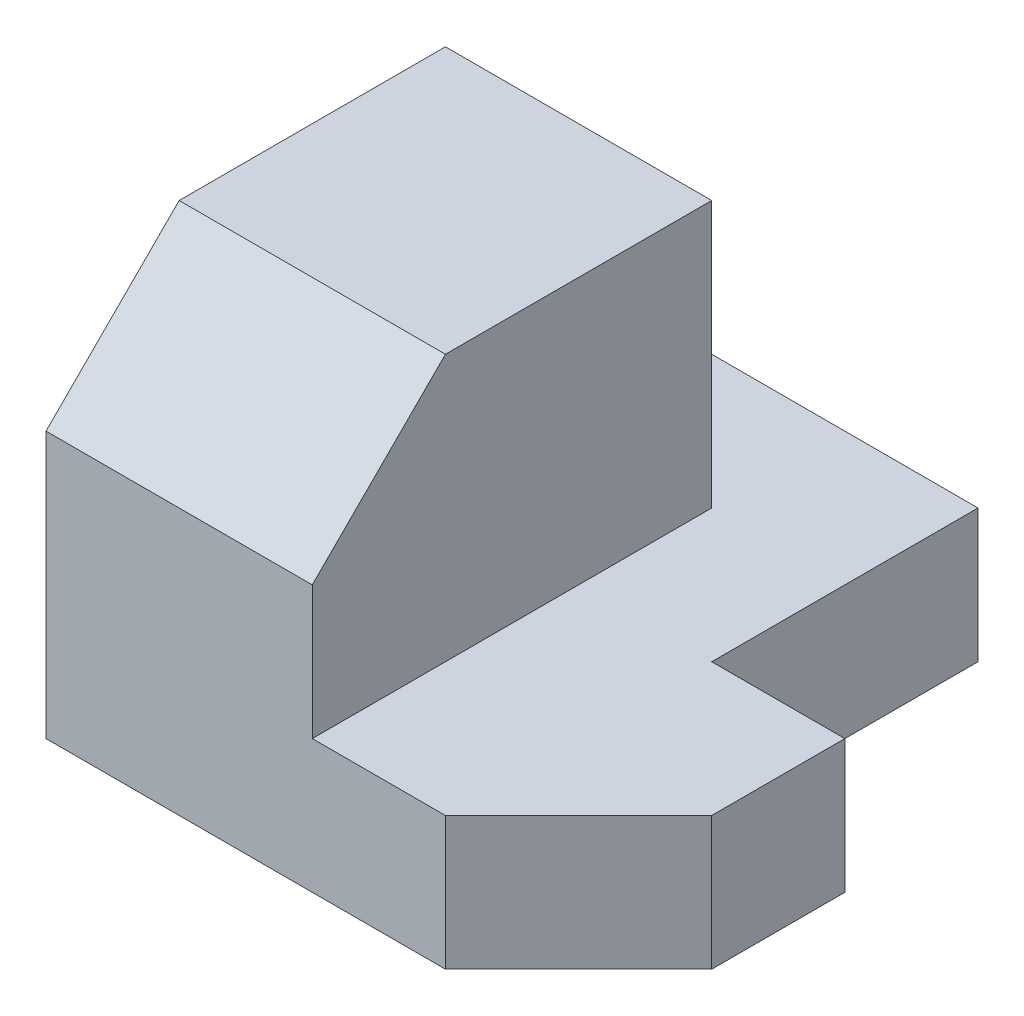
ISO-10303-21;
HEADER;
FILE_DESCRIPTION(('STEP AP214'),'2;1');
FILE_NAME('part.step','',(''),(''),'','','');
FILE_SCHEMA(('AUTOMOTIVE_DESIGN { 1 0 10303 214 1 1 1 1 }'));
ENDSEC;
DATA;
#1=APPLICATION_CONTEXT('core data for automotive mechanical design processes');
#2=APPLICATION_PROTOCOL_DEFINITION('international standard','automotive_design',2000,#1);
#3=PRODUCT_CONTEXT('',#1,'mechanical');
#4=PRODUCT('Part','Part','',(#3));
#5=PRODUCT_RELATED_PRODUCT_CATEGORY('part','',(#4));
#6=PRODUCT_DEFINITION_FORMATION('','',#4);
#7=PRODUCT_DEFINITION_CONTEXT('part definition',#1,'design');
#8=PRODUCT_DEFINITION('design','',#6,#7);
#9=PRODUCT_DEFINITION_SHAPE('','',#8);
#10=(LENGTH_UNIT() NAMED_UNIT(*) SI_UNIT(.MILLI.,.METRE.));
#11=(NAMED_UNIT(*) PLANE_ANGLE_UNIT() SI_UNIT($,.RADIAN.));
#12=(NAMED_UNIT(*) SI_UNIT($,.STERADIAN.) SOLID_ANGLE_UNIT());
#13=UNCERTAINTY_MEASURE_WITH_UNIT(LENGTH_MEASURE(1.E-05),#10,'distance_accuracy_value','');
#14=(GEOMETRIC_REPRESENTATION_CONTEXT(3) GLOBAL_UNCERTAINTY_ASSIGNED_CONTEXT((#13)) GLOBAL_UNIT_ASSIGNED_CONTEXT((#10,
#11,#12)) REPRESENTATION_CONTEXT('',''));
#15=CARTESIAN_POINT('',(0.,0.,0.));
#16=DIRECTION('',(0.,0.,1.));
#17=DIRECTION('',(1.,0.,0.));
#18=AXIS2_PLACEMENT_3D('',#15,#16,#17);
#19=CARTESIAN_POINT('',(0.,1.,0.));
#20=DIRECTION('',(-1.,0.,0.));
#21=DIRECTION('',(0.,0.,1.));
#22=AXIS2_PLACEMENT_3D('',#19,#20,#21);
#23=PLANE('',#22);
#24=DIRECTION('',(0.,-0.707106781186548,0.707106781186547));
#25=VECTOR('',#24,1.);
#26=CARTESIAN_POINT('',(0.,1.5,0.5));
#27=LINE('',#26,#25);
#28=CARTESIAN_POINT('',(0.,3.,-0.999999999999999));
#29=VERTEX_POINT('',#28);
#30=CARTESIAN_POINT('',(0.,2.,0.));
#31=VERTEX_POINT('',#30);
#32=EDGE_CURVE('E118',#29,#31,#27,.T.);
#33=ORIENTED_EDGE('',*,*,#32,.F.);
#34=DIRECTION('',(0.,0.,-1.));
#35=VECTOR('',#34,1.);
#36=CARTESIAN_POINT('',(0.,3.,0.));
#37=LINE('',#36,#35);
#38=CARTESIAN_POINT('',(0.,3.,-3.));
#39=VERTEX_POINT('',#38);
#40=EDGE_CURVE('E231',#29,#39,#37,.T.);
#41=ORIENTED_EDGE('',*,*,#40,.T.);
#42=DIRECTION('',(0.,-1.,0.));
#43=VECTOR('',#42,1.);
#44=CARTESIAN_POINT('',(0.,3.,-3.));
#45=LINE('',#44,#43);
#46=CARTESIAN_POINT('',(0.,1.,-3.));
#47=VERTEX_POINT('',#46);
#48=EDGE_CURVE('E139',#39,#47,#45,.T.);
#49=ORIENTED_EDGE('',*,*,#48,.T.);
#50=DIRECTION('',(0.,0.,-1.));
#51=VECTOR('',#50,1.);
#52=CARTESIAN_POINT('',(0.,1.,0.));
#53=LINE('',#52,#51);
#54=CARTESIAN_POINT('',(0.,1.,-4.));
#55=VERTEX_POINT('',#54);
#56=EDGE_CURVE('E145',#47,#55,#53,.T.);
#57=ORIENTED_EDGE('',*,*,#56,.T.);
#58=DIRECTION('',(0.,-1.,0.));
#59=VECTOR('',#58,1.);
#60=CARTESIAN_POINT('',(0.,1.,-4.));
#61=LINE('',#60,#59);
#62=CARTESIAN_POINT('',(0.,0.,-4.));
#63=VERTEX_POINT('',#62);
#64=EDGE_CURVE('E164',#55,#63,#61,.T.);
#65=ORIENTED_EDGE('',*,*,#64,.T.);
#66=DIRECTION('',(0.,0.,-1.));
#67=VECTOR('',#66,1.);
#68=CARTESIAN_POINT('',(0.,0.,0.));
#69=LINE('',#68,#67);
#70=CARTESIAN_POINT('',(0.,0.,0.));
#71=VERTEX_POINT('',#70);
#72=EDGE_CURVE('E144',#71,#63,#69,.T.);
#73=ORIENTED_EDGE('',*,*,#72,.F.);
#74=DIRECTION('',(0.,-1.,0.));
#75=VECTOR('',#74,1.);
#76=CARTESIAN_POINT('',(0.,1.,0.));
#77=LINE('',#76,#75);
#78=EDGE_CURVE('E42',#31,#71,#77,.T.);
#79=ORIENTED_EDGE('',*,*,#78,.F.);
#80=EDGE_LOOP('',(#33,#41,#49,#57,#65,#73,#79));
#81=FACE_BOUND('',#80,.T.);
#82=ADVANCED_FACE('F35',(#81),#23,.T.);
#83=CARTESIAN_POINT('',(0.,1.,0.));
#84=DIRECTION('',(0.,0.,1.));
#85=DIRECTION('',(1.,0.,0.));
#86=AXIS2_PLACEMENT_3D('',#83,#84,#85);
#87=PLANE('',#86);
#88=DIRECTION('',(1.,0.,0.));
#89=VECTOR('',#88,1.);
#90=CARTESIAN_POINT('',(-1.,2.,0.));
#91=LINE('',#90,#89);
#92=CARTESIAN_POINT('',(2.,2.,0.));
#93=VERTEX_POINT('',#92);
#94=EDGE_CURVE('E115',#31,#93,#91,.T.);
#95=ORIENTED_EDGE('',*,*,#94,.F.);
#96=ORIENTED_EDGE('',*,*,#78,.T.);
#97=DIRECTION('',(-1.,0.,0.));
#98=VECTOR('',#97,1.);
#99=CARTESIAN_POINT('',(0.,0.,0.));
#100=LINE('',#99,#98);
#101=CARTESIAN_POINT('',(3.,0.,0.));
#102=VERTEX_POINT('',#101);
#103=EDGE_CURVE('E166',#102,#71,#100,.T.);
#104=ORIENTED_EDGE('',*,*,#103,.F.);
#105=DIRECTION('',(0.,-1.,0.));
#106=VECTOR('',#105,1.);
#107=CARTESIAN_POINT('',(3.,1.,0.));
#108=LINE('',#107,#106);
#109=CARTESIAN_POINT('',(3.,1.,0.));
#110=VERTEX_POINT('',#109);
#111=EDGE_CURVE('E193',#110,#102,#108,.T.);
#112=ORIENTED_EDGE('',*,*,#111,.F.);
#113=DIRECTION('',(-1.,0.,0.));
#114=VECTOR('',#113,1.);
#115=CARTESIAN_POINT('',(0.,1.,0.));
#116=LINE('',#115,#114);
#117=CARTESIAN_POINT('',(2.,1.,0.));
#118=VERTEX_POINT('',#117);
#119=EDGE_CURVE('E133',#110,#118,#116,.T.);
#120=ORIENTED_EDGE('',*,*,#119,.T.);
#121=DIRECTION('',(0.,-1.,0.));
#122=VECTOR('',#121,1.);
#123=CARTESIAN_POINT('',(2.,3.,0.));
#124=LINE('',#123,#122);
#125=EDGE_CURVE('E126',#93,#118,#124,.T.);
#126=ORIENTED_EDGE('',*,*,#125,.F.);
#127=EDGE_LOOP('',(#95,#96,#104,#112,#120,#126));
#128=FACE_BOUND('',#127,.T.);
#129=ADVANCED_FACE('F131',(#128),#87,.T.);
#130=CARTESIAN_POINT('',(1.5,1.,1.5));
#131=DIRECTION('',(0.707106781186547,0.,0.707106781186548));
#132=DIRECTION('',(0.707106781186548,0.,-0.707106781186547));
#133=AXIS2_PLACEMENT_3D('',#130,#131,#132);
#134=PLANE('',#133);
#135=DIRECTION('',(-0.707106781186548,0.,0.707106781186547));
#136=VECTOR('',#135,1.);
#137=CARTESIAN_POINT('',(1.5,0.,1.5));
#138=LINE('',#137,#136);
#139=CARTESIAN_POINT('',(4.,0.,-0.999999999999997));
#140=VERTEX_POINT('',#139);
#141=EDGE_CURVE('E169',#140,#102,#138,.T.);
#142=ORIENTED_EDGE('',*,*,#141,.F.);
#143=DIRECTION('',(0.,-1.,0.));
#144=VECTOR('',#143,1.);
#145=CARTESIAN_POINT('',(4.,1.,-0.999999999999997));
#146=LINE('',#145,#144);
#147=CARTESIAN_POINT('',(4.,1.,-0.999999999999997));
#148=VERTEX_POINT('',#147);
#149=EDGE_CURVE('E191',#148,#140,#146,.T.);
#150=ORIENTED_EDGE('',*,*,#149,.F.);
#151=DIRECTION('',(-0.707106781186548,0.,0.707106781186547));
#152=VECTOR('',#151,1.);
#153=CARTESIAN_POINT('',(1.5,1.,1.5));
#154=LINE('',#153,#152);
#155=EDGE_CURVE('E149',#148,#110,#154,.T.);
#156=ORIENTED_EDGE('',*,*,#155,.T.);
#157=ORIENTED_EDGE('',*,*,#111,.T.);
#158=EDGE_LOOP('',(#142,#150,#156,#157));
#159=FACE_BOUND('',#158,.T.);
#160=ADVANCED_FACE('F220',(#159),#134,.T.);
#161=CARTESIAN_POINT('',(4.,1.,0.));
#162=DIRECTION('',(1.,0.,0.));
#163=DIRECTION('',(0.,0.,-1.));
#164=AXIS2_PLACEMENT_3D('',#161,#162,#163);
#165=PLANE('',#164);
#166=DIRECTION('',(0.,0.,1.));
#167=VECTOR('',#166,1.);
#168=CARTESIAN_POINT('',(4.,0.,0.));
#169=LINE('',#168,#167);
#170=CARTESIAN_POINT('',(4.,0.,-2.));
#171=VERTEX_POINT('',#170);
#172=EDGE_CURVE('E172',#171,#140,#169,.T.);
#173=ORIENTED_EDGE('',*,*,#172,.F.);
#174=DIRECTION('',(0.,-1.,0.));
#175=VECTOR('',#174,1.);
#176=CARTESIAN_POINT('',(4.,1.,-2.));
#177=LINE('',#176,#175);
#178=CARTESIAN_POINT('',(4.,1.,-2.));
#179=VERTEX_POINT('',#178);
#180=EDGE_CURVE('E189',#179,#171,#177,.T.);
#181=ORIENTED_EDGE('',*,*,#180,.F.);
#182=DIRECTION('',(0.,0.,1.));
#183=VECTOR('',#182,1.);
#184=CARTESIAN_POINT('',(4.,1.,0.));
#185=LINE('',#184,#183);
#186=EDGE_CURVE('E152',#179,#148,#185,.T.);
#187=ORIENTED_EDGE('',*,*,#186,.T.);
#188=ORIENTED_EDGE('',*,*,#149,.T.);
#189=EDGE_LOOP('',(#173,#181,#187,#188));
#190=FACE_BOUND('',#189,.T.);
#191=ADVANCED_FACE('F217',(#190),#165,.T.);
#192=CARTESIAN_POINT('',(0.,1.,-2.00000000000001));
#193=DIRECTION('',(0.,0.,-1.));
#194=DIRECTION('',(-1.,0.,0.));
#195=AXIS2_PLACEMENT_3D('',#192,#193,#194);
#196=PLANE('',#195);
#197=DIRECTION('',(1.,0.,0.));
#198=VECTOR('',#197,1.);
#199=CARTESIAN_POINT('',(0.,0.,-2.00000000000001));
#200=LINE('',#199,#198);
#201=CARTESIAN_POINT('',(3.,0.,-2.));
#202=VERTEX_POINT('',#201);
#203=EDGE_CURVE('E175',#202,#171,#200,.T.);
#204=ORIENTED_EDGE('',*,*,#203,.F.);
#205=DIRECTION('',(0.,-1.,0.));
#206=VECTOR('',#205,1.);
#207=CARTESIAN_POINT('',(3.,1.,-2.));
#208=LINE('',#207,#206);
#209=CARTESIAN_POINT('',(3.,1.,-2.));
#210=VERTEX_POINT('',#209);
#211=EDGE_CURVE('E187',#210,#202,#208,.T.);
#212=ORIENTED_EDGE('',*,*,#211,.F.);
#213=DIRECTION('',(1.,0.,0.));
#214=VECTOR('',#213,1.);
#215=CARTESIAN_POINT('',(0.,1.,-2.00000000000001));
#216=LINE('',#215,#214);
#217=EDGE_CURVE('E155',#210,#179,#216,.T.);
#218=ORIENTED_EDGE('',*,*,#217,.T.);
#219=ORIENTED_EDGE('',*,*,#180,.T.);
#220=EDGE_LOOP('',(#204,#212,#218,#219));
#221=FACE_BOUND('',#220,.T.);
#222=ADVANCED_FACE('F213',(#221),#196,.T.);
#223=CARTESIAN_POINT('',(3.,1.,0.));
#224=DIRECTION('',(1.,0.,0.));
#225=DIRECTION('',(0.,0.,-1.));
#226=AXIS2_PLACEMENT_3D('',#223,#224,#225);
#227=PLANE('',#226);
#228=DIRECTION('',(0.,0.,1.));
#229=VECTOR('',#228,1.);
#230=CARTESIAN_POINT('',(3.,0.,0.));
#231=LINE('',#230,#229);
#232=CARTESIAN_POINT('',(3.,0.,-4.));
#233=VERTEX_POINT('',#232);
#234=EDGE_CURVE('E178',#233,#202,#231,.T.);
#235=ORIENTED_EDGE('',*,*,#234,.F.);
#236=DIRECTION('',(0.,-1.,0.));
#237=VECTOR('',#236,1.);
#238=CARTESIAN_POINT('',(3.,1.,-4.));
#239=LINE('',#238,#237);
#240=CARTESIAN_POINT('',(3.,1.,-4.));
#241=VERTEX_POINT('',#240);
#242=EDGE_CURVE('E185',#241,#233,#239,.T.);
#243=ORIENTED_EDGE('',*,*,#242,.F.);
#244=DIRECTION('',(0.,0.,1.));
#245=VECTOR('',#244,1.);
#246=CARTESIAN_POINT('',(3.,1.,0.));
#247=LINE('',#246,#245);
#248=EDGE_CURVE('E158',#241,#210,#247,.T.);
#249=ORIENTED_EDGE('',*,*,#248,.T.);
#250=ORIENTED_EDGE('',*,*,#211,.T.);
#251=EDGE_LOOP('',(#235,#243,#249,#250));
#252=FACE_BOUND('',#251,.T.);
#253=ADVANCED_FACE('F209',(#252),#227,.T.);
#254=CARTESIAN_POINT('',(0.,1.,-4.));
#255=DIRECTION('',(0.,0.,-1.));
#256=DIRECTION('',(-1.,0.,0.));
#257=AXIS2_PLACEMENT_3D('',#254,#255,#256);
#258=PLANE('',#257);
#259=DIRECTION('',(1.,0.,0.));
#260=VECTOR('',#259,1.);
#261=CARTESIAN_POINT('',(0.,0.,-4.));
#262=LINE('',#261,#260);
#263=EDGE_CURVE('E147',#63,#233,#262,.T.);
#264=ORIENTED_EDGE('',*,*,#263,.F.);
#265=ORIENTED_EDGE('',*,*,#64,.F.);
#266=DIRECTION('',(1.,0.,0.));
#267=VECTOR('',#266,1.);
#268=CARTESIAN_POINT('',(0.,1.,-4.));
#269=LINE('',#268,#267);
#270=EDGE_CURVE('E161',#55,#241,#269,.T.);
#271=ORIENTED_EDGE('',*,*,#270,.T.);
#272=ORIENTED_EDGE('',*,*,#242,.T.);
#273=EDGE_LOOP('',(#264,#265,#271,#272));
#274=FACE_BOUND('',#273,.T.);
#275=ADVANCED_FACE('F205',(#274),#258,.T.);
#276=CARTESIAN_POINT('',(0.,1.,0.));
#277=DIRECTION('',(0.,1.,0.));
#278=DIRECTION('',(0.,0.,1.));
#279=AXIS2_PLACEMENT_3D('',#276,#277,#278);
#280=PLANE('',#279);
#281=DIRECTION('',(0.,0.,-1.));
#282=VECTOR('',#281,1.);
#283=CARTESIAN_POINT('',(2.,1.,0.));
#284=LINE('',#283,#282);
#285=CARTESIAN_POINT('',(2.,1.,-3.));
#286=VERTEX_POINT('',#285);
#287=EDGE_CURVE('E136',#118,#286,#284,.T.);
#288=ORIENTED_EDGE('',*,*,#287,.F.);
#289=ORIENTED_EDGE('',*,*,#119,.F.);
#290=ORIENTED_EDGE('',*,*,#155,.F.);
#291=ORIENTED_EDGE('',*,*,#186,.F.);
#292=ORIENTED_EDGE('',*,*,#217,.F.);
#293=ORIENTED_EDGE('',*,*,#248,.F.);
#294=ORIENTED_EDGE('',*,*,#270,.F.);
#295=ORIENTED_EDGE('',*,*,#56,.F.);
#296=DIRECTION('',(-1.,0.,0.));
#297=VECTOR('',#296,1.);
#298=CARTESIAN_POINT('',(0.,1.,-3.));
#299=LINE('',#298,#297);
#300=EDGE_CURVE('E56',#286,#47,#299,.T.);
#301=ORIENTED_EDGE('',*,*,#300,.F.);
#302=EDGE_LOOP('',(#288,#289,#290,#291,#292,#293,#294,#295,#301));
#303=FACE_BOUND('',#302,.T.);
#304=ADVANCED_FACE('F221',(#303),#280,.T.);
#305=CARTESIAN_POINT('',(0.,0.,0.));
#306=DIRECTION('',(0.,1.,0.));
#307=DIRECTION('',(0.,0.,1.));
#308=AXIS2_PLACEMENT_3D('',#305,#306,#307);
#309=PLANE('',#308);
#310=ORIENTED_EDGE('',*,*,#103,.T.);
#311=ORIENTED_EDGE('',*,*,#72,.T.);
#312=ORIENTED_EDGE('',*,*,#263,.T.);
#313=ORIENTED_EDGE('',*,*,#234,.T.);
#314=ORIENTED_EDGE('',*,*,#203,.T.);
#315=ORIENTED_EDGE('',*,*,#172,.T.);
#316=ORIENTED_EDGE('',*,*,#141,.T.);
#317=EDGE_LOOP('',(#310,#311,#312,#313,#314,#315,#316));
#318=FACE_BOUND('',#317,.T.);
#319=ADVANCED_FACE('F198',(#318),#309,.F.);
#320=CARTESIAN_POINT('',(2.,3.,0.));
#321=DIRECTION('',(1.,0.,0.));
#322=DIRECTION('',(0.,0.,-1.));
#323=AXIS2_PLACEMENT_3D('',#320,#321,#322);
#324=PLANE('',#323);
#325=DIRECTION('',(0.,0.707106781186548,-0.707106781186547));
#326=VECTOR('',#325,1.);
#327=CARTESIAN_POINT('',(2.,2.,0.));
#328=LINE('',#327,#326);
#329=CARTESIAN_POINT('',(2.,3.,-0.999999999999999));
#330=VERTEX_POINT('',#329);
#331=EDGE_CURVE('E48',#93,#330,#328,.T.);
#332=ORIENTED_EDGE('',*,*,#331,.F.);
#333=ORIENTED_EDGE('',*,*,#125,.T.);
#334=ORIENTED_EDGE('',*,*,#287,.T.);
#335=DIRECTION('',(0.,-1.,0.));
#336=VECTOR('',#335,1.);
#337=CARTESIAN_POINT('',(2.,3.,-3.));
#338=LINE('',#337,#336);
#339=CARTESIAN_POINT('',(2.,3.,-3.));
#340=VERTEX_POINT('',#339);
#341=EDGE_CURVE('E134',#340,#286,#338,.T.);
#342=ORIENTED_EDGE('',*,*,#341,.F.);
#343=DIRECTION('',(0.,0.,1.));
#344=VECTOR('',#343,1.);
#345=CARTESIAN_POINT('',(2.,3.,0.));
#346=LINE('',#345,#344);
#347=EDGE_CURVE('E128',#340,#330,#346,.T.);
#348=ORIENTED_EDGE('',*,*,#347,.T.);
#349=EDGE_LOOP('',(#332,#333,#334,#342,#348));
#350=FACE_BOUND('',#349,.T.);
#351=ADVANCED_FACE('F125',(#350),#324,.T.);
#352=CARTESIAN_POINT('',(0.,3.,-3.));
#353=DIRECTION('',(0.,0.,-1.));
#354=DIRECTION('',(-1.,0.,0.));
#355=AXIS2_PLACEMENT_3D('',#352,#353,#354);
#356=PLANE('',#355);
#357=ORIENTED_EDGE('',*,*,#341,.T.);
#358=ORIENTED_EDGE('',*,*,#300,.T.);
#359=ORIENTED_EDGE('',*,*,#48,.F.);
#360=DIRECTION('',(1.,0.,0.));
#361=VECTOR('',#360,1.);
#362=CARTESIAN_POINT('',(0.,3.,-3.));
#363=LINE('',#362,#361);
#364=EDGE_CURVE('E227',#39,#340,#363,.T.);
#365=ORIENTED_EDGE('',*,*,#364,.T.);
#366=EDGE_LOOP('',(#357,#358,#359,#365));
#367=FACE_BOUND('',#366,.T.);
#368=ADVANCED_FACE('F224',(#367),#356,.T.);
#369=CARTESIAN_POINT('',(0.,3.,0.));
#370=DIRECTION('',(0.,1.,0.));
#371=DIRECTION('',(0.,0.,1.));
#372=AXIS2_PLACEMENT_3D('',#369,#370,#371);
#373=PLANE('',#372);
#374=DIRECTION('',(-1.,0.,0.));
#375=VECTOR('',#374,1.);
#376=CARTESIAN_POINT('',(0.,3.,-0.999999999999999));
#377=LINE('',#376,#375);
#378=EDGE_CURVE('E11',#330,#29,#377,.T.);
#379=ORIENTED_EDGE('',*,*,#378,.F.);
#380=ORIENTED_EDGE('',*,*,#347,.F.);
#381=ORIENTED_EDGE('',*,*,#364,.F.);
#382=ORIENTED_EDGE('',*,*,#40,.F.);
#383=EDGE_LOOP('',(#379,#380,#381,#382));
#384=FACE_BOUND('',#383,.T.);
#385=ADVANCED_FACE('F235',(#384),#373,.T.);
#386=CARTESIAN_POINT('',(-1.,2.,0.));
#387=DIRECTION('',(0.,-0.707106781186547,-0.707106781186548));
#388=DIRECTION('',(0.,0.707106781186548,-0.707106781186547));
#389=AXIS2_PLACEMENT_3D('',#386,#387,#388);
#390=PLANE('',#389);
#391=ORIENTED_EDGE('',*,*,#32,.T.);
#392=ORIENTED_EDGE('',*,*,#94,.T.);
#393=ORIENTED_EDGE('',*,*,#331,.T.);
#394=ORIENTED_EDGE('',*,*,#378,.T.);
#395=EDGE_LOOP('',(#391,#392,#393,#394));
#396=FACE_BOUND('',#395,.T.);
#397=ADVANCED_FACE('F116',(#396),#390,.F.);
#398=CLOSED_SHELL('',(#82,#129,#160,#191,#222,#253,#275,#304,#319,#351,#368,#385,#397));
#399=MANIFOLD_SOLID_BREP('B2',#398);
#400=ADVANCED_BREP_SHAPE_REPRESENTATION('',(#18,#399),#14);
#401=SHAPE_DEFINITION_REPRESENTATION(#9,#400);
ENDSEC;
END-ISO-10303-21;
